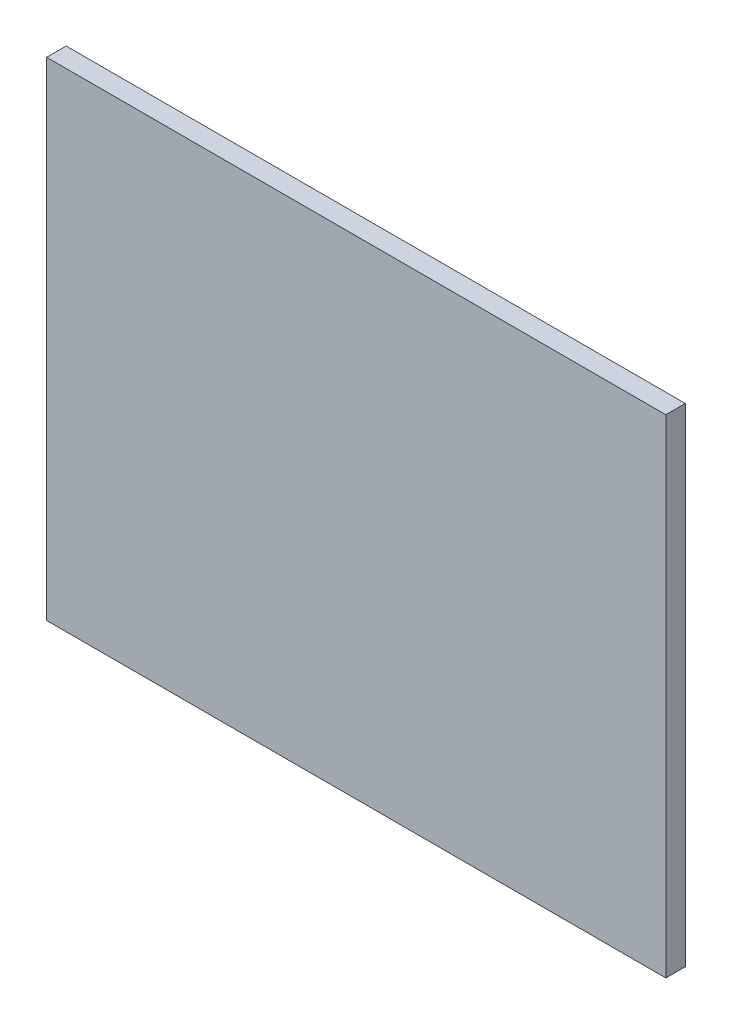
ISO-10303-21;
HEADER;
FILE_DESCRIPTION(('STEP AP214'),'2;1');
FILE_NAME('part.step','',(''),(''),'','','');
FILE_SCHEMA(('AUTOMOTIVE_DESIGN { 1 0 10303 214 1 1 1 1 }'));
ENDSEC;
DATA;
#1=APPLICATION_CONTEXT('core data for automotive mechanical design processes');
#2=APPLICATION_PROTOCOL_DEFINITION('international standard','automotive_design',2000,#1);
#3=PRODUCT_CONTEXT('',#1,'mechanical');
#4=PRODUCT('Part','Part','',(#3));
#5=PRODUCT_RELATED_PRODUCT_CATEGORY('part','',(#4));
#6=PRODUCT_DEFINITION_FORMATION('','',#4);
#7=PRODUCT_DEFINITION_CONTEXT('part definition',#1,'design');
#8=PRODUCT_DEFINITION('design','',#6,#7);
#9=PRODUCT_DEFINITION_SHAPE('','',#8);
#10=(LENGTH_UNIT() NAMED_UNIT(*) SI_UNIT(.MILLI.,.METRE.));
#11=(NAMED_UNIT(*) PLANE_ANGLE_UNIT() SI_UNIT($,.RADIAN.));
#12=(NAMED_UNIT(*) SI_UNIT($,.STERADIAN.) SOLID_ANGLE_UNIT());
#13=UNCERTAINTY_MEASURE_WITH_UNIT(LENGTH_MEASURE(1.E-05),#10,'distance_accuracy_value','');
#14=(GEOMETRIC_REPRESENTATION_CONTEXT(3) GLOBAL_UNCERTAINTY_ASSIGNED_CONTEXT((#13)) GLOBAL_UNIT_ASSIGNED_CONTEXT((#10,
#11,#12)) REPRESENTATION_CONTEXT('',''));
#15=CARTESIAN_POINT('',(0.,0.,0.));
#16=DIRECTION('',(0.,0.,1.));
#17=DIRECTION('',(1.,0.,0.));
#18=AXIS2_PLACEMENT_3D('',#15,#16,#17);
#19=CARTESIAN_POINT('',(-301.5,-237.5,19.));
#20=DIRECTION('',(1.,0.,0.));
#21=DIRECTION('',(0.,0.,-1.));
#22=AXIS2_PLACEMENT_3D('',#19,#20,#21);
#23=PLANE('',#22);
#24=DIRECTION('',(0.,-1.,0.));
#25=VECTOR('',#24,1.);
#26=CARTESIAN_POINT('',(-301.5,-237.5,0.));
#27=LINE('',#26,#25);
#28=CARTESIAN_POINT('',(-301.5,237.5,0.));
#29=VERTEX_POINT('',#28);
#30=CARTESIAN_POINT('',(-301.5,-237.5,0.));
#31=VERTEX_POINT('',#30);
#32=EDGE_CURVE('E96',#29,#31,#27,.T.);
#33=ORIENTED_EDGE('',*,*,#32,.T.);
#34=DIRECTION('',(0.,0.,-1.));
#35=VECTOR('',#34,1.);
#36=CARTESIAN_POINT('',(-301.5,-237.5,19.));
#37=LINE('',#36,#35);
#38=CARTESIAN_POINT('',(-301.5,-237.5,19.));
#39=VERTEX_POINT('',#38);
#40=EDGE_CURVE('E11',#39,#31,#37,.T.);
#41=ORIENTED_EDGE('',*,*,#40,.F.);
#42=DIRECTION('',(0.,-1.,0.));
#43=VECTOR('',#42,1.);
#44=CARTESIAN_POINT('',(-301.5,-237.5,19.));
#45=LINE('',#44,#43);
#46=CARTESIAN_POINT('',(-301.5,237.5,19.));
#47=VERTEX_POINT('',#46);
#48=EDGE_CURVE('E84',#47,#39,#45,.T.);
#49=ORIENTED_EDGE('',*,*,#48,.F.);
#50=DIRECTION('',(0.,0.,-1.));
#51=VECTOR('',#50,1.);
#52=CARTESIAN_POINT('',(-301.5,237.5,19.));
#53=LINE('',#52,#51);
#54=EDGE_CURVE('E92',#47,#29,#53,.T.);
#55=ORIENTED_EDGE('',*,*,#54,.T.);
#56=EDGE_LOOP('',(#33,#41,#49,#55));
#57=FACE_BOUND('',#56,.T.);
#58=ADVANCED_FACE('F33',(#57),#23,.F.);
#59=CARTESIAN_POINT('',(301.5,-237.5,19.));
#60=DIRECTION('',(0.,1.,0.));
#61=DIRECTION('',(-1.,0.,0.));
#62=AXIS2_PLACEMENT_3D('',#59,#60,#61);
#63=PLANE('',#62);
#64=DIRECTION('',(1.,0.,0.));
#65=VECTOR('',#64,1.);
#66=CARTESIAN_POINT('',(301.5,-237.5,0.));
#67=LINE('',#66,#65);
#68=CARTESIAN_POINT('',(301.5,-237.5,0.));
#69=VERTEX_POINT('',#68);
#70=EDGE_CURVE('E88',#31,#69,#67,.T.);
#71=ORIENTED_EDGE('',*,*,#70,.T.);
#72=DIRECTION('',(0.,0.,-1.));
#73=VECTOR('',#72,1.);
#74=CARTESIAN_POINT('',(301.5,-237.5,19.));
#75=LINE('',#74,#73);
#76=CARTESIAN_POINT('',(301.5,-237.5,19.));
#77=VERTEX_POINT('',#76);
#78=EDGE_CURVE('E41',#77,#69,#75,.T.);
#79=ORIENTED_EDGE('',*,*,#78,.F.);
#80=DIRECTION('',(1.,0.,0.));
#81=VECTOR('',#80,1.);
#82=CARTESIAN_POINT('',(301.5,-237.5,19.));
#83=LINE('',#82,#81);
#84=EDGE_CURVE('E79',#39,#77,#83,.T.);
#85=ORIENTED_EDGE('',*,*,#84,.F.);
#86=ORIENTED_EDGE('',*,*,#40,.T.);
#87=EDGE_LOOP('',(#71,#79,#85,#86));
#88=FACE_BOUND('',#87,.T.);
#89=ADVANCED_FACE('F87',(#88),#63,.F.);
#90=CARTESIAN_POINT('',(301.5,-237.5,19.));
#91=DIRECTION('',(-1.,0.,0.));
#92=DIRECTION('',(0.,-1.,0.));
#93=AXIS2_PLACEMENT_3D('',#90,#91,#92);
#94=PLANE('',#93);
#95=DIRECTION('',(0.,1.,0.));
#96=VECTOR('',#95,1.);
#97=CARTESIAN_POINT('',(301.5,-237.5,0.));
#98=LINE('',#97,#96);
#99=CARTESIAN_POINT('',(301.5,237.5,0.));
#100=VERTEX_POINT('',#99);
#101=EDGE_CURVE('E66',#69,#100,#98,.T.);
#102=ORIENTED_EDGE('',*,*,#101,.T.);
#103=DIRECTION('',(0.,0.,-1.));
#104=VECTOR('',#103,1.);
#105=CARTESIAN_POINT('',(301.5,237.5,19.));
#106=LINE('',#105,#104);
#107=CARTESIAN_POINT('',(301.5,237.5,19.));
#108=VERTEX_POINT('',#107);
#109=EDGE_CURVE('E89',#108,#100,#106,.T.);
#110=ORIENTED_EDGE('',*,*,#109,.F.);
#111=DIRECTION('',(0.,1.,0.));
#112=VECTOR('',#111,1.);
#113=CARTESIAN_POINT('',(301.5,-237.5,19.));
#114=LINE('',#113,#112);
#115=EDGE_CURVE('E82',#77,#108,#114,.T.);
#116=ORIENTED_EDGE('',*,*,#115,.F.);
#117=ORIENTED_EDGE('',*,*,#78,.T.);
#118=EDGE_LOOP('',(#102,#110,#116,#117));
#119=FACE_BOUND('',#118,.T.);
#120=ADVANCED_FACE('F90',(#119),#94,.F.);
#121=CARTESIAN_POINT('',(301.5,237.5,19.));
#122=DIRECTION('',(0.,-1.,0.));
#123=DIRECTION('',(1.,0.,0.));
#124=AXIS2_PLACEMENT_3D('',#121,#122,#123);
#125=PLANE('',#124);
#126=DIRECTION('',(-1.,0.,0.));
#127=VECTOR('',#126,1.);
#128=CARTESIAN_POINT('',(301.5,237.5,0.));
#129=LINE('',#128,#127);
#130=EDGE_CURVE('E72',#100,#29,#129,.T.);
#131=ORIENTED_EDGE('',*,*,#130,.T.);
#132=ORIENTED_EDGE('',*,*,#54,.F.);
#133=DIRECTION('',(-1.,0.,0.));
#134=VECTOR('',#133,1.);
#135=CARTESIAN_POINT('',(301.5,237.5,19.));
#136=LINE('',#135,#134);
#137=EDGE_CURVE('E49',#108,#47,#136,.T.);
#138=ORIENTED_EDGE('',*,*,#137,.F.);
#139=ORIENTED_EDGE('',*,*,#109,.T.);
#140=EDGE_LOOP('',(#131,#132,#138,#139));
#141=FACE_BOUND('',#140,.T.);
#142=ADVANCED_FACE('F103',(#141),#125,.F.);
#143=CARTESIAN_POINT('',(0.,0.,19.));
#144=DIRECTION('',(0.,0.,1.));
#145=DIRECTION('',(1.,0.,0.));
#146=AXIS2_PLACEMENT_3D('',#143,#144,#145);
#147=PLANE('',#146);
#148=ORIENTED_EDGE('',*,*,#48,.T.);
#149=ORIENTED_EDGE('',*,*,#84,.T.);
#150=ORIENTED_EDGE('',*,*,#115,.T.);
#151=ORIENTED_EDGE('',*,*,#137,.T.);
#152=EDGE_LOOP('',(#148,#149,#150,#151));
#153=FACE_BOUND('',#152,.T.);
#154=ADVANCED_FACE('F80',(#153),#147,.T.);
#155=CARTESIAN_POINT('',(0.,0.,0.));
#156=DIRECTION('',(0.,0.,1.));
#157=DIRECTION('',(1.,0.,0.));
#158=AXIS2_PLACEMENT_3D('',#155,#156,#157);
#159=PLANE('',#158);
#160=ORIENTED_EDGE('',*,*,#32,.F.);
#161=ORIENTED_EDGE('',*,*,#130,.F.);
#162=ORIENTED_EDGE('',*,*,#101,.F.);
#163=ORIENTED_EDGE('',*,*,#70,.F.);
#164=EDGE_LOOP('',(#160,#161,#162,#163));
#165=FACE_BOUND('',#164,.T.);
#166=ADVANCED_FACE('F106',(#165),#159,.F.);
#167=CLOSED_SHELL('',(#58,#89,#120,#142,#154,#166));
#168=MANIFOLD_SOLID_BREP('B2',#167);
#169=ADVANCED_BREP_SHAPE_REPRESENTATION('',(#18,#168),#14);
#170=SHAPE_DEFINITION_REPRESENTATION(#9,#169);
ENDSEC;
END-ISO-10303-21;
